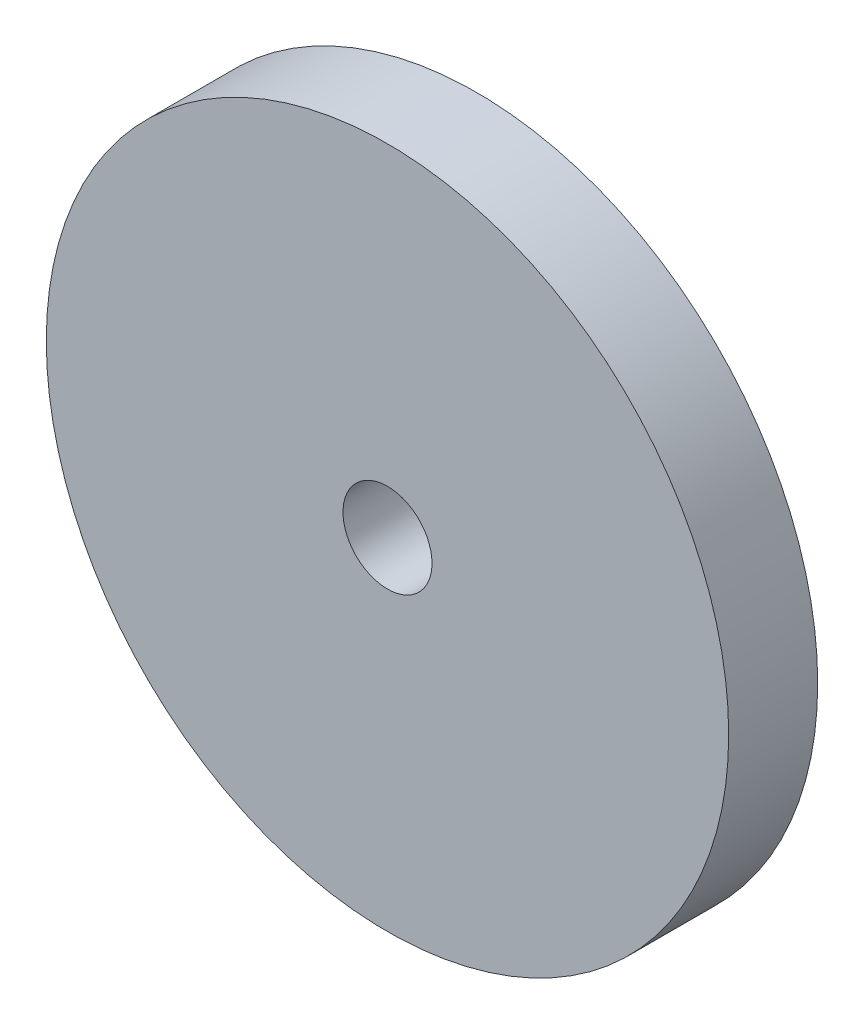
ISO-10303-21;
HEADER;
FILE_DESCRIPTION(('STEP AP214'),'2;1');
FILE_NAME('part.step','',(''),(''),'','','');
FILE_SCHEMA(('AUTOMOTIVE_DESIGN { 1 0 10303 214 1 1 1 1 }'));
ENDSEC;
DATA;
#1=APPLICATION_CONTEXT('core data for automotive mechanical design processes');
#2=APPLICATION_PROTOCOL_DEFINITION('international standard','automotive_design',2000,#1);
#3=PRODUCT_CONTEXT('',#1,'mechanical');
#4=PRODUCT('Part','Part','',(#3));
#5=PRODUCT_RELATED_PRODUCT_CATEGORY('part','',(#4));
#6=PRODUCT_DEFINITION_FORMATION('','',#4);
#7=PRODUCT_DEFINITION_CONTEXT('part definition',#1,'design');
#8=PRODUCT_DEFINITION('design','',#6,#7);
#9=PRODUCT_DEFINITION_SHAPE('','',#8);
#10=(LENGTH_UNIT() NAMED_UNIT(*) SI_UNIT(.MILLI.,.METRE.));
#11=(NAMED_UNIT(*) PLANE_ANGLE_UNIT() SI_UNIT($,.RADIAN.));
#12=(NAMED_UNIT(*) SI_UNIT($,.STERADIAN.) SOLID_ANGLE_UNIT());
#13=UNCERTAINTY_MEASURE_WITH_UNIT(LENGTH_MEASURE(1.E-05),#10,'distance_accuracy_value','');
#14=(GEOMETRIC_REPRESENTATION_CONTEXT(3) GLOBAL_UNCERTAINTY_ASSIGNED_CONTEXT((#13)) GLOBAL_UNIT_ASSIGNED_CONTEXT((#10,
#11,#12)) REPRESENTATION_CONTEXT('',''));
#15=CARTESIAN_POINT('',(0.,0.,0.));
#16=DIRECTION('',(0.,0.,1.));
#17=DIRECTION('',(1.,0.,0.));
#18=AXIS2_PLACEMENT_3D('',#15,#16,#17);
#19=CARTESIAN_POINT('',(0.,0.,3.));
#20=DIRECTION('',(0.,0.,1.));
#21=DIRECTION('',(1.,0.,0.));
#22=AXIS2_PLACEMENT_3D('',#19,#20,#21);
#23=PLANE('',#22);
#24=CARTESIAN_POINT('',(0.,0.,3.));
#25=DIRECTION('',(0.,0.,1.));
#26=DIRECTION('',(1.,0.,0.));
#27=AXIS2_PLACEMENT_3D('',#24,#25,#26);
#28=CIRCLE('',#27,11.5);
#29=CARTESIAN_POINT('',(11.5,0.,3.));
#30=VERTEX_POINT('',#29);
#31=EDGE_CURVE('E11',#30,#30,#28,.T.);
#32=ORIENTED_EDGE('',*,*,#31,.T.);
#33=EDGE_LOOP('',(#32));
#34=FACE_BOUND('',#33,.T.);
#35=CARTESIAN_POINT('',(0.,0.,3.));
#36=DIRECTION('',(0.,0.,1.));
#37=DIRECTION('',(1.,0.,0.));
#38=AXIS2_PLACEMENT_3D('',#35,#36,#37);
#39=CIRCLE('',#38,1.5);
#40=CARTESIAN_POINT('',(1.5,0.,3.));
#41=VERTEX_POINT('',#40);
#42=EDGE_CURVE('E45',#41,#41,#39,.T.);
#43=ORIENTED_EDGE('',*,*,#42,.F.);
#44=EDGE_LOOP('',(#43));
#45=FACE_BOUND('',#44,.T.);
#46=ADVANCED_FACE('F34',(#34,#45),#23,.T.);
#47=CARTESIAN_POINT('',(0.,0.,0.));
#48=DIRECTION('',(0.,0.,1.));
#49=DIRECTION('',(1.,0.,0.));
#50=AXIS2_PLACEMENT_3D('',#47,#48,#49);
#51=PLANE('',#50);
#52=CARTESIAN_POINT('',(0.,0.,0.));
#53=DIRECTION('',(0.,0.,1.));
#54=DIRECTION('',(1.,0.,0.));
#55=AXIS2_PLACEMENT_3D('',#52,#53,#54);
#56=CIRCLE('',#55,11.5);
#57=CARTESIAN_POINT('',(11.5,0.,0.));
#58=VERTEX_POINT('',#57);
#59=EDGE_CURVE('E38',#58,#58,#56,.T.);
#60=ORIENTED_EDGE('',*,*,#59,.F.);
#61=EDGE_LOOP('',(#60));
#62=FACE_BOUND('',#61,.T.);
#63=CARTESIAN_POINT('',(0.,0.,0.));
#64=DIRECTION('',(0.,0.,1.));
#65=DIRECTION('',(1.,0.,0.));
#66=AXIS2_PLACEMENT_3D('',#63,#64,#65);
#67=CIRCLE('',#66,1.5);
#68=CARTESIAN_POINT('',(1.5,0.,0.));
#69=VERTEX_POINT('',#68);
#70=EDGE_CURVE('E47',#69,#69,#67,.T.);
#71=ORIENTED_EDGE('',*,*,#70,.T.);
#72=EDGE_LOOP('',(#71));
#73=FACE_BOUND('',#72,.T.);
#74=ADVANCED_FACE('F57',(#62,#73),#51,.F.);
#75=CARTESIAN_POINT('',(0.,0.,3.));
#76=DIRECTION('',(0.,0.,-1.));
#77=DIRECTION('',(-1.,0.,0.));
#78=AXIS2_PLACEMENT_3D('',#75,#76,#77);
#79=CYLINDRICAL_SURFACE('',#78,11.5);
#80=ORIENTED_EDGE('',*,*,#31,.F.);
#81=EDGE_LOOP('',(#80));
#82=FACE_BOUND('',#81,.T.);
#83=ORIENTED_EDGE('',*,*,#59,.T.);
#84=EDGE_LOOP('',(#83));
#85=FACE_BOUND('',#84,.T.);
#86=ADVANCED_FACE('F36',(#82,#85),#79,.T.);
#87=CARTESIAN_POINT('',(0.,0.,3.));
#88=DIRECTION('',(0.,0.,-1.));
#89=DIRECTION('',(-1.,0.,0.));
#90=AXIS2_PLACEMENT_3D('',#87,#88,#89);
#91=CYLINDRICAL_SURFACE('',#90,1.5);
#92=ORIENTED_EDGE('',*,*,#42,.T.);
#93=EDGE_LOOP('',(#92));
#94=FACE_BOUND('',#93,.T.);
#95=ORIENTED_EDGE('',*,*,#70,.F.);
#96=EDGE_LOOP('',(#95));
#97=FACE_BOUND('',#96,.T.);
#98=ADVANCED_FACE('F53',(#94,#97),#91,.F.);
#99=CLOSED_SHELL('',(#46,#74,#86,#98));
#100=MANIFOLD_SOLID_BREP('B2',#99);
#101=ADVANCED_BREP_SHAPE_REPRESENTATION('',(#18,#100),#14);
#102=SHAPE_DEFINITION_REPRESENTATION(#9,#101);
ENDSEC;
END-ISO-10303-21;
